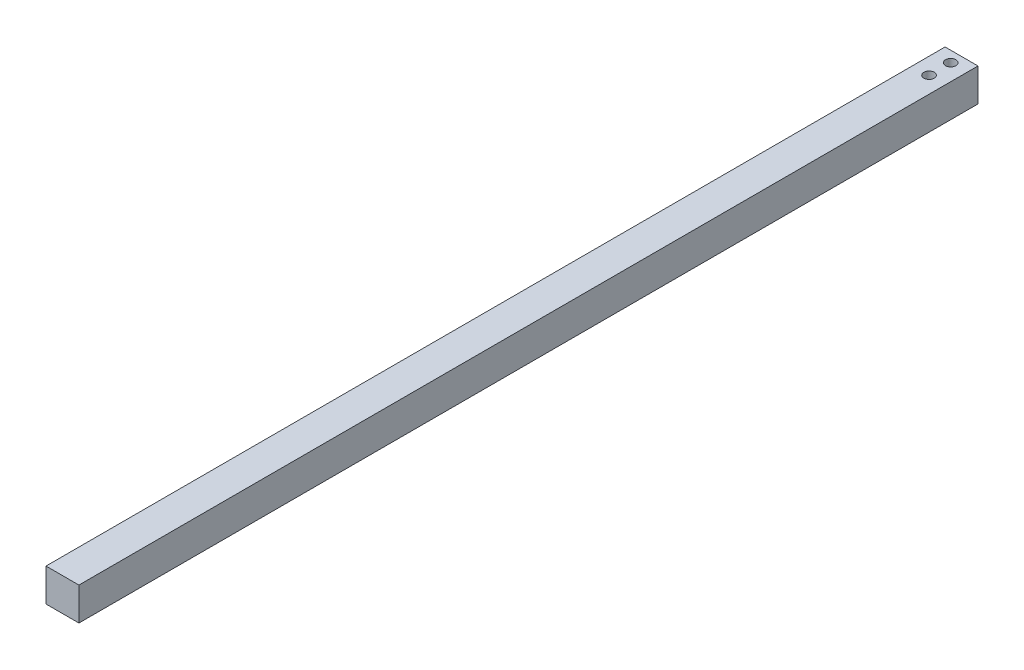
ISO-10303-21;
HEADER;
FILE_DESCRIPTION(('STEP AP214'),'2;1');
FILE_NAME('part.step','',(''),(''),'','','');
FILE_SCHEMA(('AUTOMOTIVE_DESIGN { 1 0 10303 214 1 1 1 1 }'));
ENDSEC;
DATA;
#1=APPLICATION_CONTEXT('core data for automotive mechanical design processes');
#2=APPLICATION_PROTOCOL_DEFINITION('international standard','automotive_design',2000,#1);
#3=PRODUCT_CONTEXT('',#1,'mechanical');
#4=PRODUCT('Part','Part','',(#3));
#5=PRODUCT_RELATED_PRODUCT_CATEGORY('part','',(#4));
#6=PRODUCT_DEFINITION_FORMATION('','',#4);
#7=PRODUCT_DEFINITION_CONTEXT('part definition',#1,'design');
#8=PRODUCT_DEFINITION('design','',#6,#7);
#9=PRODUCT_DEFINITION_SHAPE('','',#8);
#10=(LENGTH_UNIT() NAMED_UNIT(*) SI_UNIT(.MILLI.,.METRE.));
#11=(NAMED_UNIT(*) PLANE_ANGLE_UNIT() SI_UNIT($,.RADIAN.));
#12=(NAMED_UNIT(*) SI_UNIT($,.STERADIAN.) SOLID_ANGLE_UNIT());
#13=UNCERTAINTY_MEASURE_WITH_UNIT(LENGTH_MEASURE(1.E-05),#10,'distance_accuracy_value','');
#14=(GEOMETRIC_REPRESENTATION_CONTEXT(3) GLOBAL_UNCERTAINTY_ASSIGNED_CONTEXT((#13)) GLOBAL_UNIT_ASSIGNED_CONTEXT((#10,
#11,#12)) REPRESENTATION_CONTEXT('',''));
#15=CARTESIAN_POINT('',(0.,0.,0.));
#16=DIRECTION('',(0.,0.,1.));
#17=DIRECTION('',(1.,0.,0.));
#18=AXIS2_PLACEMENT_3D('',#15,#16,#17);
#19=CARTESIAN_POINT('',(-9.5,-9.5,519.));
#20=DIRECTION('',(0.,1.,0.));
#21=DIRECTION('',(0.,0.,1.));
#22=AXIS2_PLACEMENT_3D('',#19,#20,#21);
#23=PLANE('',#22);
#24=CARTESIAN_POINT('',(0.,-9.5,18.75));
#25=DIRECTION('',(0.,1.,0.));
#26=DIRECTION('',(0.,0.,1.));
#27=AXIS2_PLACEMENT_3D('',#24,#25,#26);
#28=CIRCLE('',#27,3.);
#29=CARTESIAN_POINT('',(0.,-9.5,21.75));
#30=VERTEX_POINT('',#29);
#31=EDGE_CURVE('E117',#30,#30,#28,.T.);
#32=ORIENTED_EDGE('',*,*,#31,.T.);
#33=EDGE_LOOP('',(#32));
#34=FACE_BOUND('',#33,.T.);
#35=CARTESIAN_POINT('',(5.99999999999998,-9.5,515.25));
#36=DIRECTION('',(0.,-1.,0.));
#37=DIRECTION('',(0.,0.,-1.));
#38=AXIS2_PLACEMENT_3D('',#35,#36,#37);
#39=CIRCLE('',#38,1.99999999999999);
#40=CARTESIAN_POINT('',(5.99999999999998,-9.5,513.25));
#41=VERTEX_POINT('',#40);
#42=EDGE_CURVE('E115',#41,#41,#39,.T.);
#43=ORIENTED_EDGE('',*,*,#42,.F.);
#44=EDGE_LOOP('',(#43));
#45=FACE_BOUND('',#44,.T.);
#46=DIRECTION('',(1.,0.,0.));
#47=VECTOR('',#46,1.);
#48=CARTESIAN_POINT('',(-9.5,-9.5,0.));
#49=LINE('',#48,#47);
#50=CARTESIAN_POINT('',(-9.5,-9.5,0.));
#51=VERTEX_POINT('',#50);
#52=CARTESIAN_POINT('',(9.5,-9.5,0.));
#53=VERTEX_POINT('',#52);
#54=EDGE_CURVE('E75',#51,#53,#49,.T.);
#55=ORIENTED_EDGE('',*,*,#54,.T.);
#56=DIRECTION('',(0.,0.,-1.));
#57=VECTOR('',#56,1.);
#58=CARTESIAN_POINT('',(9.5,-9.5,519.));
#59=LINE('',#58,#57);
#60=CARTESIAN_POINT('',(9.5,-9.5,519.));
#61=VERTEX_POINT('',#60);
#62=EDGE_CURVE('E97',#61,#53,#59,.T.);
#63=ORIENTED_EDGE('',*,*,#62,.F.);
#64=DIRECTION('',(1.,0.,0.));
#65=VECTOR('',#64,1.);
#66=CARTESIAN_POINT('',(-9.5,-9.5,519.));
#67=LINE('',#66,#65);
#68=CARTESIAN_POINT('',(-9.5,-9.5,519.));
#69=VERTEX_POINT('',#68);
#70=EDGE_CURVE('E52',#69,#61,#67,.T.);
#71=ORIENTED_EDGE('',*,*,#70,.F.);
#72=DIRECTION('',(0.,0.,-1.));
#73=VECTOR('',#72,1.);
#74=CARTESIAN_POINT('',(-9.5,-9.5,519.));
#75=LINE('',#74,#73);
#76=EDGE_CURVE('E93',#69,#51,#75,.T.);
#77=ORIENTED_EDGE('',*,*,#76,.T.);
#78=EDGE_LOOP('',(#55,#63,#71,#77));
#79=FACE_BOUND('',#78,.T.);
#80=CARTESIAN_POINT('',(-6.00000000000006,-9.5,515.25));
#81=DIRECTION('',(0.,-1.,0.));
#82=DIRECTION('',(0.,0.,-1.));
#83=AXIS2_PLACEMENT_3D('',#80,#81,#82);
#84=CIRCLE('',#83,1.99999999999999);
#85=CARTESIAN_POINT('',(-6.00000000000006,-9.5,513.25));
#86=VERTEX_POINT('',#85);
#87=EDGE_CURVE('E126',#86,#86,#84,.F.);
#88=ORIENTED_EDGE('',*,*,#87,.T.);
#89=EDGE_LOOP('',(#88));
#90=FACE_BOUND('',#89,.T.);
#91=CARTESIAN_POINT('',(0.,-9.5,6.25));
#92=DIRECTION('',(0.,1.,0.));
#93=DIRECTION('',(0.,0.,1.));
#94=AXIS2_PLACEMENT_3D('',#91,#92,#93);
#95=CIRCLE('',#94,3.);
#96=CARTESIAN_POINT('',(0.,-9.5,9.24999999999999));
#97=VERTEX_POINT('',#96);
#98=EDGE_CURVE('E111',#97,#97,#95,.F.);
#99=ORIENTED_EDGE('',*,*,#98,.F.);
#100=EDGE_LOOP('',(#99));
#101=FACE_BOUND('',#100,.T.);
#102=ADVANCED_FACE('F33',(#34,#45,#79,#90,#101),#23,.F.);
#103=CARTESIAN_POINT('',(-9.5,9.5,519.));
#104=DIRECTION('',(0.,-1.,0.));
#105=DIRECTION('',(0.,0.,-1.));
#106=AXIS2_PLACEMENT_3D('',#103,#104,#105);
#107=PLANE('',#106);
#108=CARTESIAN_POINT('',(0.,9.5,18.75));
#109=DIRECTION('',(0.,-1.,0.));
#110=DIRECTION('',(0.,0.,-1.));
#111=AXIS2_PLACEMENT_3D('',#108,#109,#110);
#112=CIRCLE('',#111,3.);
#113=CARTESIAN_POINT('',(0.,9.5,15.75));
#114=VERTEX_POINT('',#113);
#115=EDGE_CURVE('E109',#114,#114,#112,.T.);
#116=ORIENTED_EDGE('',*,*,#115,.T.);
#117=EDGE_LOOP('',(#116));
#118=FACE_BOUND('',#117,.T.);
#119=DIRECTION('',(-1.,0.,0.));
#120=VECTOR('',#119,1.);
#121=CARTESIAN_POINT('',(-9.5,9.5,0.));
#122=LINE('',#121,#120);
#123=CARTESIAN_POINT('',(9.5,9.5,0.));
#124=VERTEX_POINT('',#123);
#125=CARTESIAN_POINT('',(-9.5,9.5,0.));
#126=VERTEX_POINT('',#125);
#127=EDGE_CURVE('E92',#124,#126,#122,.T.);
#128=ORIENTED_EDGE('',*,*,#127,.T.);
#129=DIRECTION('',(0.,0.,-1.));
#130=VECTOR('',#129,1.);
#131=CARTESIAN_POINT('',(-9.5,9.5,519.));
#132=LINE('',#131,#130);
#133=CARTESIAN_POINT('',(-9.5,9.5,519.));
#134=VERTEX_POINT('',#133);
#135=EDGE_CURVE('E43',#134,#126,#132,.T.);
#136=ORIENTED_EDGE('',*,*,#135,.F.);
#137=DIRECTION('',(-1.,0.,0.));
#138=VECTOR('',#137,1.);
#139=CARTESIAN_POINT('',(-9.5,9.5,519.));
#140=LINE('',#139,#138);
#141=CARTESIAN_POINT('',(9.5,9.5,519.));
#142=VERTEX_POINT('',#141);
#143=EDGE_CURVE('E82',#142,#134,#140,.T.);
#144=ORIENTED_EDGE('',*,*,#143,.F.);
#145=DIRECTION('',(0.,0.,-1.));
#146=VECTOR('',#145,1.);
#147=CARTESIAN_POINT('',(9.5,9.5,519.));
#148=LINE('',#147,#146);
#149=EDGE_CURVE('E11',#142,#124,#148,.T.);
#150=ORIENTED_EDGE('',*,*,#149,.T.);
#151=EDGE_LOOP('',(#128,#136,#144,#150));
#152=FACE_BOUND('',#151,.T.);
#153=CARTESIAN_POINT('',(0.,9.5,6.25));
#154=DIRECTION('',(0.,-1.,0.));
#155=DIRECTION('',(0.,0.,-1.));
#156=AXIS2_PLACEMENT_3D('',#153,#154,#155);
#157=CIRCLE('',#156,3.);
#158=CARTESIAN_POINT('',(0.,9.5,3.25));
#159=VERTEX_POINT('',#158);
#160=EDGE_CURVE('E37',#159,#159,#157,.F.);
#161=ORIENTED_EDGE('',*,*,#160,.F.);
#162=EDGE_LOOP('',(#161));
#163=FACE_BOUND('',#162,.T.);
#164=ADVANCED_FACE('F90',(#118,#152,#163),#107,.F.);
#165=CARTESIAN_POINT('',(9.5,-9.5,519.));
#166=DIRECTION('',(-1.,0.,0.));
#167=DIRECTION('',(0.,0.,1.));
#168=AXIS2_PLACEMENT_3D('',#165,#166,#167);
#169=PLANE('',#168);
#170=DIRECTION('',(0.,1.,0.));
#171=VECTOR('',#170,1.);
#172=CARTESIAN_POINT('',(9.5,-9.5,0.));
#173=LINE('',#172,#171);
#174=EDGE_CURVE('E101',#53,#124,#173,.T.);
#175=ORIENTED_EDGE('',*,*,#174,.T.);
#176=ORIENTED_EDGE('',*,*,#149,.F.);
#177=DIRECTION('',(0.,1.,0.));
#178=VECTOR('',#177,1.);
#179=CARTESIAN_POINT('',(9.5,-9.5,519.));
#180=LINE('',#179,#178);
#181=EDGE_CURVE('E87',#61,#142,#180,.T.);
#182=ORIENTED_EDGE('',*,*,#181,.F.);
#183=ORIENTED_EDGE('',*,*,#62,.T.);
#184=EDGE_LOOP('',(#175,#176,#182,#183));
#185=FACE_BOUND('',#184,.T.);
#186=ADVANCED_FACE('F35',(#185),#169,.F.);
#187=CARTESIAN_POINT('',(-9.5,-9.5,519.));
#188=DIRECTION('',(1.,0.,0.));
#189=DIRECTION('',(0.,0.,-1.));
#190=AXIS2_PLACEMENT_3D('',#187,#188,#189);
#191=PLANE('',#190);
#192=DIRECTION('',(0.,-1.,0.));
#193=VECTOR('',#192,1.);
#194=CARTESIAN_POINT('',(-9.5,-9.5,0.));
#195=LINE('',#194,#193);
#196=EDGE_CURVE('E69',#126,#51,#195,.T.);
#197=ORIENTED_EDGE('',*,*,#196,.T.);
#198=ORIENTED_EDGE('',*,*,#76,.F.);
#199=DIRECTION('',(0.,-1.,0.));
#200=VECTOR('',#199,1.);
#201=CARTESIAN_POINT('',(-9.5,-9.5,519.));
#202=LINE('',#201,#200);
#203=EDGE_CURVE('E85',#134,#69,#202,.T.);
#204=ORIENTED_EDGE('',*,*,#203,.F.);
#205=ORIENTED_EDGE('',*,*,#135,.T.);
#206=EDGE_LOOP('',(#197,#198,#204,#205));
#207=FACE_BOUND('',#206,.T.);
#208=ADVANCED_FACE('F95',(#207),#191,.F.);
#209=CARTESIAN_POINT('',(0.,0.,519.));
#210=DIRECTION('',(0.,0.,-1.));
#211=DIRECTION('',(-1.,0.,0.));
#212=AXIS2_PLACEMENT_3D('',#209,#210,#211);
#213=PLANE('',#212);
#214=ORIENTED_EDGE('',*,*,#181,.T.);
#215=ORIENTED_EDGE('',*,*,#143,.T.);
#216=ORIENTED_EDGE('',*,*,#203,.T.);
#217=ORIENTED_EDGE('',*,*,#70,.T.);
#218=EDGE_LOOP('',(#214,#215,#216,#217));
#219=FACE_BOUND('',#218,.T.);
#220=ADVANCED_FACE('F83',(#219),#213,.F.);
#221=CARTESIAN_POINT('',(0.,0.,0.));
#222=DIRECTION('',(0.,0.,-1.));
#223=DIRECTION('',(-1.,0.,0.));
#224=AXIS2_PLACEMENT_3D('',#221,#222,#223);
#225=PLANE('',#224);
#226=ORIENTED_EDGE('',*,*,#174,.F.);
#227=ORIENTED_EDGE('',*,*,#54,.F.);
#228=ORIENTED_EDGE('',*,*,#196,.F.);
#229=ORIENTED_EDGE('',*,*,#127,.F.);
#230=EDGE_LOOP('',(#226,#227,#228,#229));
#231=FACE_BOUND('',#230,.T.);
#232=ADVANCED_FACE('F163',(#231),#225,.T.);
#233=CARTESIAN_POINT('',(5.99999999999998,-0.5,515.25));
#234=DIRECTION('',(0.,-1.,0.));
#235=DIRECTION('',(0.,0.,-1.));
#236=AXIS2_PLACEMENT_3D('',#233,#234,#235);
#237=CYLINDRICAL_SURFACE('',#236,1.99999999999999);
#238=CARTESIAN_POINT('',(5.99999999999998,-0.5,515.25));
#239=DIRECTION('',(0.,-1.,0.));
#240=DIRECTION('',(0.,0.,-1.));
#241=AXIS2_PLACEMENT_3D('',#238,#239,#240);
#242=CIRCLE('',#241,1.99999999999999);
#243=CARTESIAN_POINT('',(5.99999999999998,-0.5,513.25));
#244=VERTEX_POINT('',#243);
#245=EDGE_CURVE('E129',#244,#244,#242,.T.);
#246=ORIENTED_EDGE('',*,*,#245,.F.);
#247=EDGE_LOOP('',(#246));
#248=FACE_BOUND('',#247,.T.);
#249=ORIENTED_EDGE('',*,*,#42,.T.);
#250=EDGE_LOOP('',(#249));
#251=FACE_BOUND('',#250,.T.);
#252=ADVANCED_FACE('F135',(#248,#251),#237,.F.);
#253=CARTESIAN_POINT('',(0.,-0.5,0.));
#254=DIRECTION('',(0.,-1.,0.));
#255=DIRECTION('',(0.,0.,-1.));
#256=AXIS2_PLACEMENT_3D('',#253,#254,#255);
#257=PLANE('',#256);
#258=ORIENTED_EDGE('',*,*,#245,.T.);
#259=EDGE_LOOP('',(#258));
#260=FACE_BOUND('',#259,.T.);
#261=ADVANCED_FACE('F147',(#260),#257,.T.);
#262=CARTESIAN_POINT('',(-6.00000000000006,-0.5,515.25));
#263=DIRECTION('',(0.,-1.,0.));
#264=DIRECTION('',(0.,0.,-1.));
#265=AXIS2_PLACEMENT_3D('',#262,#263,#264);
#266=CYLINDRICAL_SURFACE('',#265,1.99999999999999);
#267=CARTESIAN_POINT('',(-6.00000000000006,-0.5,515.25));
#268=DIRECTION('',(0.,-1.,0.));
#269=DIRECTION('',(0.,0.,-1.));
#270=AXIS2_PLACEMENT_3D('',#267,#268,#269);
#271=CIRCLE('',#270,1.99999999999999);
#272=CARTESIAN_POINT('',(-6.00000000000006,-0.5,513.25));
#273=VERTEX_POINT('',#272);
#274=EDGE_CURVE('E104',#273,#273,#271,.F.);
#275=ORIENTED_EDGE('',*,*,#274,.T.);
#276=EDGE_LOOP('',(#275));
#277=FACE_BOUND('',#276,.T.);
#278=ORIENTED_EDGE('',*,*,#87,.F.);
#279=EDGE_LOOP('',(#278));
#280=FACE_BOUND('',#279,.T.);
#281=ADVANCED_FACE('F144',(#277,#280),#266,.F.);
#282=CARTESIAN_POINT('',(0.,-0.5,0.));
#283=DIRECTION('',(0.,-1.,0.));
#284=DIRECTION('',(0.,0.,-1.));
#285=AXIS2_PLACEMENT_3D('',#282,#283,#284);
#286=PLANE('',#285);
#287=ORIENTED_EDGE('',*,*,#274,.F.);
#288=EDGE_LOOP('',(#287));
#289=FACE_BOUND('',#288,.T.);
#290=ADVANCED_FACE('F146',(#289),#286,.T.);
#291=CARTESIAN_POINT('',(0.,-9.5,18.75));
#292=DIRECTION('',(0.,1.,0.));
#293=DIRECTION('',(0.,0.,1.));
#294=AXIS2_PLACEMENT_3D('',#291,#292,#293);
#295=CYLINDRICAL_SURFACE('',#294,3.);
#296=ORIENTED_EDGE('',*,*,#31,.F.);
#297=EDGE_LOOP('',(#296));
#298=FACE_BOUND('',#297,.T.);
#299=ORIENTED_EDGE('',*,*,#115,.F.);
#300=EDGE_LOOP('',(#299));
#301=FACE_BOUND('',#300,.T.);
#302=ADVANCED_FACE('F154',(#298,#301),#295,.F.);
#303=CARTESIAN_POINT('',(0.,-9.5,6.25));
#304=DIRECTION('',(0.,1.,0.));
#305=DIRECTION('',(0.,0.,1.));
#306=AXIS2_PLACEMENT_3D('',#303,#304,#305);
#307=CYLINDRICAL_SURFACE('',#306,3.);
#308=ORIENTED_EDGE('',*,*,#98,.T.);
#309=EDGE_LOOP('',(#308));
#310=FACE_BOUND('',#309,.T.);
#311=ORIENTED_EDGE('',*,*,#160,.T.);
#312=EDGE_LOOP('',(#311));
#313=FACE_BOUND('',#312,.T.);
#314=ADVANCED_FACE('F230',(#310,#313),#307,.F.);
#315=CLOSED_SHELL('',(#102,#164,#186,#208,#220,#232,#252,#261,#281,#290,#302,#314));
#316=MANIFOLD_SOLID_BREP('B2',#315);
#317=ADVANCED_BREP_SHAPE_REPRESENTATION('',(#18,#316),#14);
#318=SHAPE_DEFINITION_REPRESENTATION(#9,#317);
ENDSEC;
END-ISO-10303-21;
